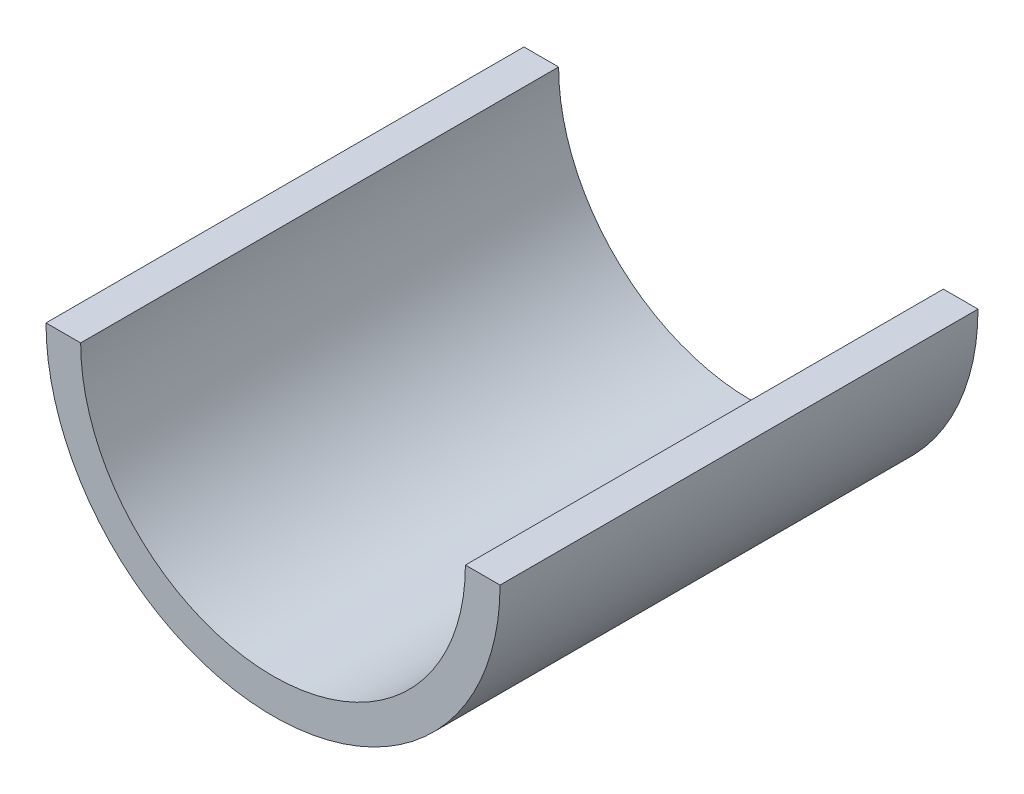
ISO-10303-21;
HEADER;
FILE_DESCRIPTION(('STEP AP214'),'2;1');
FILE_NAME('part.step','',(''),(''),'','','');
FILE_SCHEMA(('AUTOMOTIVE_DESIGN { 1 0 10303 214 1 1 1 1 }'));
ENDSEC;
DATA;
#1=APPLICATION_CONTEXT('core data for automotive mechanical design processes');
#2=APPLICATION_PROTOCOL_DEFINITION('international standard','automotive_design',2000,#1);
#3=PRODUCT_CONTEXT('',#1,'mechanical');
#4=PRODUCT('Part','Part','',(#3));
#5=PRODUCT_RELATED_PRODUCT_CATEGORY('part','',(#4));
#6=PRODUCT_DEFINITION_FORMATION('','',#4);
#7=PRODUCT_DEFINITION_CONTEXT('part definition',#1,'design');
#8=PRODUCT_DEFINITION('design','',#6,#7);
#9=PRODUCT_DEFINITION_SHAPE('','',#8);
#10=(LENGTH_UNIT() NAMED_UNIT(*) SI_UNIT(.MILLI.,.METRE.));
#11=(NAMED_UNIT(*) PLANE_ANGLE_UNIT() SI_UNIT($,.RADIAN.));
#12=(NAMED_UNIT(*) SI_UNIT($,.STERADIAN.) SOLID_ANGLE_UNIT());
#13=UNCERTAINTY_MEASURE_WITH_UNIT(LENGTH_MEASURE(1.E-05),#10,'distance_accuracy_value','');
#14=(GEOMETRIC_REPRESENTATION_CONTEXT(3) GLOBAL_UNCERTAINTY_ASSIGNED_CONTEXT((#13)) GLOBAL_UNIT_ASSIGNED_CONTEXT((#10,
#11,#12)) REPRESENTATION_CONTEXT('',''));
#15=CARTESIAN_POINT('',(0.,0.,0.));
#16=DIRECTION('',(0.,0.,1.));
#17=DIRECTION('',(1.,0.,0.));
#18=AXIS2_PLACEMENT_3D('',#15,#16,#17);
#19=CARTESIAN_POINT('',(-8.83256515256271,12.7254187797917,0.));
#20=DIRECTION('',(0.,0.,1.));
#21=DIRECTION('',(1.,0.,0.));
#22=AXIS2_PLACEMENT_3D('',#19,#20,#21);
#23=CYLINDRICAL_SURFACE('',#22,20.447);
#24=CARTESIAN_POINT('',(-8.83256515256271,12.7254187797917,0.));
#25=DIRECTION('',(0.,0.,1.));
#26=DIRECTION('',(1.,0.,0.));
#27=AXIS2_PLACEMENT_3D('',#24,#25,#26);
#28=CIRCLE('',#27,20.447);
#29=CARTESIAN_POINT('',(11.6144348474373,12.7254187797917,0.));
#30=VERTEX_POINT('',#29);
#31=CARTESIAN_POINT('',(-29.2795651525628,12.7254187797917,0.));
#32=VERTEX_POINT('',#31);
#33=EDGE_CURVE('E20',#30,#32,#28,.F.);
#34=ORIENTED_EDGE('',*,*,#33,.T.);
#35=DIRECTION('',(0.,0.,1.));
#36=VECTOR('',#35,1.);
#37=CARTESIAN_POINT('',(-29.2795651525628,12.7254187797917,0.));
#38=LINE('',#37,#36);
#39=CARTESIAN_POINT('',(-29.2795651525628,12.7254187797917,50.8));
#40=VERTEX_POINT('',#39);
#41=EDGE_CURVE('E80',#40,#32,#38,.F.);
#42=ORIENTED_EDGE('',*,*,#41,.F.);
#43=CARTESIAN_POINT('',(-8.83256515256271,12.7254187797917,50.8));
#44=DIRECTION('',(0.,0.,1.));
#45=DIRECTION('',(1.,0.,0.));
#46=AXIS2_PLACEMENT_3D('',#43,#44,#45);
#47=CIRCLE('',#46,20.447);
#48=CARTESIAN_POINT('',(11.6144348474373,12.7254187797917,50.8));
#49=VERTEX_POINT('',#48);
#50=EDGE_CURVE('E67',#49,#40,#47,.F.);
#51=ORIENTED_EDGE('',*,*,#50,.F.);
#52=DIRECTION('',(0.,0.,1.));
#53=VECTOR('',#52,1.);
#54=CARTESIAN_POINT('',(11.6144348474373,12.7254187797917,0.));
#55=LINE('',#54,#53);
#56=EDGE_CURVE('E66',#30,#49,#55,.T.);
#57=ORIENTED_EDGE('',*,*,#56,.F.);
#58=EDGE_LOOP('',(#34,#42,#51,#57));
#59=FACE_BOUND('',#58,.T.);
#60=ADVANCED_FACE('F17',(#59),#23,.F.);
#61=CARTESIAN_POINT('',(-8.83256515256271,-0.119815105298495,0.));
#62=DIRECTION('',(0.,0.,1.));
#63=DIRECTION('',(1.,0.,0.));
#64=AXIS2_PLACEMENT_3D('',#61,#62,#63);
#65=PLANE('',#64);
#66=ORIENTED_EDGE('',*,*,#33,.F.);
#67=DIRECTION('',(1.,0.,0.));
#68=VECTOR('',#67,1.);
#69=CARTESIAN_POINT('',(11.6144348474373,12.7254187797917,0.));
#70=LINE('',#69,#68);
#71=CARTESIAN_POINT('',(15.2974348474373,12.7254187797917,0.));
#72=VERTEX_POINT('',#71);
#73=EDGE_CURVE('E58',#72,#30,#70,.F.);
#74=ORIENTED_EDGE('',*,*,#73,.F.);
#75=CARTESIAN_POINT('',(-8.83256515256271,12.7254187797917,0.));
#76=DIRECTION('',(0.,0.,1.));
#77=DIRECTION('',(1.,0.,0.));
#78=AXIS2_PLACEMENT_3D('',#75,#76,#77);
#79=CIRCLE('',#78,24.13);
#80=CARTESIAN_POINT('',(-32.9625651525627,12.7254187797917,0.));
#81=VERTEX_POINT('',#80);
#82=EDGE_CURVE('E81',#81,#72,#79,.T.);
#83=ORIENTED_EDGE('',*,*,#82,.F.);
#84=DIRECTION('',(1.,0.,0.));
#85=VECTOR('',#84,1.);
#86=CARTESIAN_POINT('',(-32.9625651525626,12.7254187797917,0.));
#87=LINE('',#86,#85);
#88=EDGE_CURVE('E61',#32,#81,#87,.F.);
#89=ORIENTED_EDGE('',*,*,#88,.F.);
#90=EDGE_LOOP('',(#66,#74,#83,#89));
#91=FACE_BOUND('',#90,.T.);
#92=ADVANCED_FACE('F56',(#91),#65,.F.);
#93=CARTESIAN_POINT('',(11.6144348474373,12.7254187797917,0.));
#94=DIRECTION('',(0.,1.,0.));
#95=DIRECTION('',(0.,0.,1.));
#96=AXIS2_PLACEMENT_3D('',#93,#94,#95);
#97=PLANE('',#96);
#98=DIRECTION('',(1.,0.,0.));
#99=VECTOR('',#98,1.);
#100=CARTESIAN_POINT('',(-8.83256515256271,12.7254187797917,50.8));
#101=LINE('',#100,#99);
#102=CARTESIAN_POINT('',(15.2974348474373,12.7254187797917,50.8));
#103=VERTEX_POINT('',#102);
#104=EDGE_CURVE('E79',#103,#49,#101,.F.);
#105=ORIENTED_EDGE('',*,*,#104,.F.);
#106=DIRECTION('',(0.,0.,1.));
#107=VECTOR('',#106,1.);
#108=CARTESIAN_POINT('',(15.2974348474373,12.7254187797917,0.));
#109=LINE('',#108,#107);
#110=EDGE_CURVE('E73',#72,#103,#109,.T.);
#111=ORIENTED_EDGE('',*,*,#110,.F.);
#112=ORIENTED_EDGE('',*,*,#73,.T.);
#113=ORIENTED_EDGE('',*,*,#56,.T.);
#114=EDGE_LOOP('',(#105,#111,#112,#113));
#115=FACE_BOUND('',#114,.T.);
#116=ADVANCED_FACE('F71',(#115),#97,.T.);
#117=CARTESIAN_POINT('',(-8.83256515256271,-0.119815105298495,50.8));
#118=DIRECTION('',(0.,0.,1.));
#119=DIRECTION('',(1.,0.,0.));
#120=AXIS2_PLACEMENT_3D('',#117,#118,#119);
#121=PLANE('',#120);
#122=CARTESIAN_POINT('',(-8.83256515256271,12.7254187797917,50.8));
#123=DIRECTION('',(0.,0.,1.));
#124=DIRECTION('',(1.,0.,0.));
#125=AXIS2_PLACEMENT_3D('',#122,#123,#124);
#126=CIRCLE('',#125,24.13);
#127=CARTESIAN_POINT('',(-32.9625651525627,12.7254187797917,50.8));
#128=VERTEX_POINT('',#127);
#129=EDGE_CURVE('E26',#103,#128,#126,.F.);
#130=ORIENTED_EDGE('',*,*,#129,.F.);
#131=ORIENTED_EDGE('',*,*,#104,.T.);
#132=ORIENTED_EDGE('',*,*,#50,.T.);
#133=DIRECTION('',(1.,0.,0.));
#134=VECTOR('',#133,1.);
#135=CARTESIAN_POINT('',(-32.9625651525626,12.7254187797917,50.8));
#136=LINE('',#135,#134);
#137=EDGE_CURVE('E35',#128,#40,#136,.T.);
#138=ORIENTED_EDGE('',*,*,#137,.F.);
#139=EDGE_LOOP('',(#130,#131,#132,#138));
#140=FACE_BOUND('',#139,.T.);
#141=ADVANCED_FACE('F92',(#140),#121,.T.);
#142=CARTESIAN_POINT('',(-32.9625651525626,12.7254187797917,0.));
#143=DIRECTION('',(0.,1.,0.));
#144=DIRECTION('',(0.,0.,1.));
#145=AXIS2_PLACEMENT_3D('',#142,#143,#144);
#146=PLANE('',#145);
#147=ORIENTED_EDGE('',*,*,#137,.T.);
#148=ORIENTED_EDGE('',*,*,#41,.T.);
#149=ORIENTED_EDGE('',*,*,#88,.T.);
#150=DIRECTION('',(0.,0.,1.));
#151=VECTOR('',#150,1.);
#152=CARTESIAN_POINT('',(-32.9625651525627,12.7254187797917,0.));
#153=LINE('',#152,#151);
#154=EDGE_CURVE('E11',#128,#81,#153,.F.);
#155=ORIENTED_EDGE('',*,*,#154,.F.);
#156=EDGE_LOOP('',(#147,#148,#149,#155));
#157=FACE_BOUND('',#156,.T.);
#158=ADVANCED_FACE('F90',(#157),#146,.T.);
#159=CARTESIAN_POINT('',(-8.83256515256271,12.7254187797917,0.));
#160=DIRECTION('',(0.,0.,1.));
#161=DIRECTION('',(1.,0.,0.));
#162=AXIS2_PLACEMENT_3D('',#159,#160,#161);
#163=CYLINDRICAL_SURFACE('',#162,24.13);
#164=ORIENTED_EDGE('',*,*,#129,.T.);
#165=ORIENTED_EDGE('',*,*,#154,.T.);
#166=ORIENTED_EDGE('',*,*,#82,.T.);
#167=ORIENTED_EDGE('',*,*,#110,.T.);
#168=EDGE_LOOP('',(#164,#165,#166,#167));
#169=FACE_BOUND('',#168,.T.);
#170=ADVANCED_FACE('F88',(#169),#163,.T.);
#171=CLOSED_SHELL('',(#60,#92,#116,#141,#158,#170));
#172=MANIFOLD_SOLID_BREP('B1',#171);
#173=ADVANCED_BREP_SHAPE_REPRESENTATION('',(#18,#172),#14);
#174=SHAPE_DEFINITION_REPRESENTATION(#9,#173);
ENDSEC;
END-ISO-10303-21;
